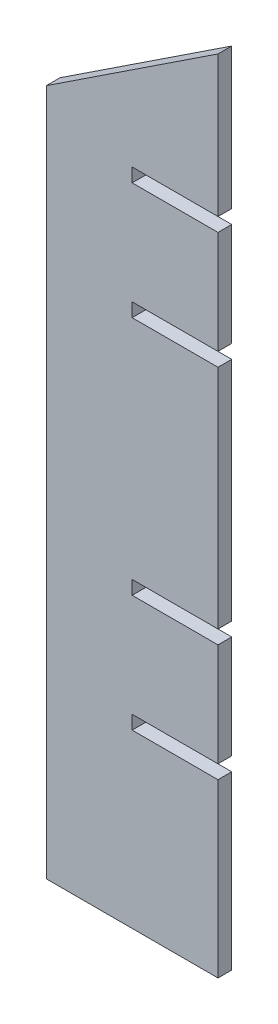
ISO-10303-21;
HEADER;
FILE_DESCRIPTION(('STEP AP214'),'2;1');
FILE_NAME('part.step','',(''),(''),'','','');
FILE_SCHEMA(('AUTOMOTIVE_DESIGN { 1 0 10303 214 1 1 1 1 }'));
ENDSEC;
DATA;
#1=APPLICATION_CONTEXT('core data for automotive mechanical design processes');
#2=APPLICATION_PROTOCOL_DEFINITION('international standard','automotive_design',2000,#1);
#3=PRODUCT_CONTEXT('',#1,'mechanical');
#4=PRODUCT('Part','Part','',(#3));
#5=PRODUCT_RELATED_PRODUCT_CATEGORY('part','',(#4));
#6=PRODUCT_DEFINITION_FORMATION('','',#4);
#7=PRODUCT_DEFINITION_CONTEXT('part definition',#1,'design');
#8=PRODUCT_DEFINITION('design','',#6,#7);
#9=PRODUCT_DEFINITION_SHAPE('','',#8);
#10=(LENGTH_UNIT() NAMED_UNIT(*) SI_UNIT(.MILLI.,.METRE.));
#11=(NAMED_UNIT(*) PLANE_ANGLE_UNIT() SI_UNIT($,.RADIAN.));
#12=(NAMED_UNIT(*) SI_UNIT($,.STERADIAN.) SOLID_ANGLE_UNIT());
#13=UNCERTAINTY_MEASURE_WITH_UNIT(LENGTH_MEASURE(1.E-05),#10,'distance_accuracy_value','');
#14=(GEOMETRIC_REPRESENTATION_CONTEXT(3) GLOBAL_UNCERTAINTY_ASSIGNED_CONTEXT((#13)) GLOBAL_UNIT_ASSIGNED_CONTEXT((#10,
#11,#12)) REPRESENTATION_CONTEXT('',''));
#15=CARTESIAN_POINT('',(0.,0.,0.));
#16=DIRECTION('',(0.,0.,1.));
#17=DIRECTION('',(1.,0.,0.));
#18=AXIS2_PLACEMENT_3D('',#15,#16,#17);
#19=CARTESIAN_POINT('',(-64.0648701838016,170.682235242793,4.));
#20=DIRECTION('',(0.550842208330738,-0.834609406561726,0.));
#21=DIRECTION('',(0.834609406561726,0.550842208330738,0.));
#22=AXIS2_PLACEMENT_3D('',#19,#20,#21);
#23=PLANE('',#22);
#24=DIRECTION('',(-0.834609406561726,-0.550842208330738,0.));
#25=VECTOR('',#24,1.);
#26=CARTESIAN_POINT('',(-64.0648701838016,170.682235242793,0.));
#27=LINE('',#26,#25);
#28=CARTESIAN_POINT('',(-64.0648701838016,170.682235242793,0.));
#29=VERTEX_POINT('',#28);
#30=CARTESIAN_POINT('',(-114.064870183802,137.682235242793,0.));
#31=VERTEX_POINT('',#30);
#32=EDGE_CURVE('E199',#29,#31,#27,.T.);
#33=ORIENTED_EDGE('',*,*,#32,.T.);
#34=DIRECTION('',(0.,0.,-1.));
#35=VECTOR('',#34,1.);
#36=CARTESIAN_POINT('',(-114.064870183802,137.682235242793,4.));
#37=LINE('',#36,#35);
#38=CARTESIAN_POINT('',(-114.064870183802,137.682235242793,4.));
#39=VERTEX_POINT('',#38);
#40=EDGE_CURVE('E11',#39,#31,#37,.T.);
#41=ORIENTED_EDGE('',*,*,#40,.F.);
#42=DIRECTION('',(-0.834609406561726,-0.550842208330738,0.));
#43=VECTOR('',#42,1.);
#44=CARTESIAN_POINT('',(-64.0648701838016,170.682235242793,4.));
#45=LINE('',#44,#43);
#46=CARTESIAN_POINT('',(-64.0648701838016,170.682235242793,4.));
#47=VERTEX_POINT('',#46);
#48=EDGE_CURVE('E237',#47,#39,#45,.T.);
#49=ORIENTED_EDGE('',*,*,#48,.F.);
#50=DIRECTION('',(0.,0.,-1.));
#51=VECTOR('',#50,1.);
#52=CARTESIAN_POINT('',(-64.0648701838016,170.682235242793,4.));
#53=LINE('',#52,#51);
#54=EDGE_CURVE('E195',#47,#29,#53,.T.);
#55=ORIENTED_EDGE('',*,*,#54,.T.);
#56=EDGE_LOOP('',(#33,#41,#49,#55));
#57=FACE_BOUND('',#56,.T.);
#58=ADVANCED_FACE('F31',(#57),#23,.F.);
#59=CARTESIAN_POINT('',(-114.064870183802,137.682235242793,4.));
#60=DIRECTION('',(1.,0.,0.));
#61=DIRECTION('',(0.,1.,0.));
#62=AXIS2_PLACEMENT_3D('',#59,#60,#61);
#63=PLANE('',#62);
#64=DIRECTION('',(0.,-1.,0.));
#65=VECTOR('',#64,1.);
#66=CARTESIAN_POINT('',(-114.064870183802,137.682235242793,0.));
#67=LINE('',#66,#65);
#68=CARTESIAN_POINT('',(-114.064870183802,-62.3177647572069,0.));
#69=VERTEX_POINT('',#68);
#70=EDGE_CURVE('E202',#31,#69,#67,.T.);
#71=ORIENTED_EDGE('',*,*,#70,.T.);
#72=DIRECTION('',(0.,0.,-1.));
#73=VECTOR('',#72,1.);
#74=CARTESIAN_POINT('',(-114.064870183802,-62.3177647572069,4.));
#75=LINE('',#74,#73);
#76=CARTESIAN_POINT('',(-114.064870183802,-62.3177647572069,4.));
#77=VERTEX_POINT('',#76);
#78=EDGE_CURVE('E39',#77,#69,#75,.T.);
#79=ORIENTED_EDGE('',*,*,#78,.F.);
#80=DIRECTION('',(0.,-1.,0.));
#81=VECTOR('',#80,1.);
#82=CARTESIAN_POINT('',(-114.064870183802,137.682235242793,4.));
#83=LINE('',#82,#81);
#84=EDGE_CURVE('E126',#39,#77,#83,.T.);
#85=ORIENTED_EDGE('',*,*,#84,.F.);
#86=ORIENTED_EDGE('',*,*,#40,.T.);
#87=EDGE_LOOP('',(#71,#79,#85,#86));
#88=FACE_BOUND('',#87,.T.);
#89=ADVANCED_FACE('F355',(#88),#63,.F.);
#90=CARTESIAN_POINT('',(-114.064870183802,-62.3177647572069,4.));
#91=DIRECTION('',(0.,1.,0.));
#92=DIRECTION('',(0.,0.,1.));
#93=AXIS2_PLACEMENT_3D('',#90,#91,#92);
#94=PLANE('',#93);
#95=DIRECTION('',(1.,0.,0.));
#96=VECTOR('',#95,1.);
#97=CARTESIAN_POINT('',(-114.064870183802,-62.3177647572069,0.));
#98=LINE('',#97,#96);
#99=CARTESIAN_POINT('',(-64.0648701838017,-62.3177647572069,0.));
#100=VERTEX_POINT('',#99);
#101=EDGE_CURVE('E204',#69,#100,#98,.T.);
#102=ORIENTED_EDGE('',*,*,#101,.T.);
#103=DIRECTION('',(0.,0.,-1.));
#104=VECTOR('',#103,1.);
#105=CARTESIAN_POINT('',(-64.0648701838017,-62.3177647572069,4.));
#106=LINE('',#105,#104);
#107=CARTESIAN_POINT('',(-64.0648701838017,-62.3177647572069,4.));
#108=VERTEX_POINT('',#107);
#109=EDGE_CURVE('E280',#108,#100,#106,.T.);
#110=ORIENTED_EDGE('',*,*,#109,.F.);
#111=DIRECTION('',(1.,0.,0.));
#112=VECTOR('',#111,1.);
#113=CARTESIAN_POINT('',(-114.064870183802,-62.3177647572069,4.));
#114=LINE('',#113,#112);
#115=EDGE_CURVE('E288',#77,#108,#114,.T.);
#116=ORIENTED_EDGE('',*,*,#115,.F.);
#117=ORIENTED_EDGE('',*,*,#78,.T.);
#118=EDGE_LOOP('',(#102,#110,#116,#117));
#119=FACE_BOUND('',#118,.T.);
#120=ADVANCED_FACE('F286',(#119),#94,.F.);
#121=CARTESIAN_POINT('',(-64.0648701838017,-62.3177647572069,4.));
#122=DIRECTION('',(-1.,0.,0.));
#123=DIRECTION('',(0.,0.,1.));
#124=AXIS2_PLACEMENT_3D('',#121,#122,#123);
#125=PLANE('',#124);
#126=DIRECTION('',(0.,1.,0.));
#127=VECTOR('',#126,1.);
#128=CARTESIAN_POINT('',(-64.0648701838017,-62.3177647572069,0.));
#129=LINE('',#128,#127);
#130=CARTESIAN_POINT('',(-64.0648701838017,-12.3177647572069,0.));
#131=VERTEX_POINT('',#130);
#132=EDGE_CURVE('E206',#100,#131,#129,.T.);
#133=ORIENTED_EDGE('',*,*,#132,.T.);
#134=DIRECTION('',(0.,0.,-1.));
#135=VECTOR('',#134,1.);
#136=CARTESIAN_POINT('',(-64.0648701838017,-12.3177647572069,4.));
#137=LINE('',#136,#135);
#138=CARTESIAN_POINT('',(-64.0648701838017,-12.3177647572069,4.));
#139=VERTEX_POINT('',#138);
#140=EDGE_CURVE('E277',#139,#131,#137,.T.);
#141=ORIENTED_EDGE('',*,*,#140,.F.);
#142=DIRECTION('',(0.,1.,0.));
#143=VECTOR('',#142,1.);
#144=CARTESIAN_POINT('',(-64.0648701838017,-62.3177647572069,4.));
#145=LINE('',#144,#143);
#146=EDGE_CURVE('E306',#108,#139,#145,.T.);
#147=ORIENTED_EDGE('',*,*,#146,.F.);
#148=ORIENTED_EDGE('',*,*,#109,.T.);
#149=EDGE_LOOP('',(#133,#141,#147,#148));
#150=FACE_BOUND('',#149,.T.);
#151=ADVANCED_FACE('F297',(#150),#125,.F.);
#152=CARTESIAN_POINT('',(-64.0648701838017,-12.3177647572069,4.));
#153=DIRECTION('',(0.,-1.,0.));
#154=DIRECTION('',(1.,0.,0.));
#155=AXIS2_PLACEMENT_3D('',#152,#153,#154);
#156=PLANE('',#155);
#157=DIRECTION('',(-1.,0.,0.));
#158=VECTOR('',#157,1.);
#159=CARTESIAN_POINT('',(-64.0648701838017,-12.3177647572069,0.));
#160=LINE('',#159,#158);
#161=CARTESIAN_POINT('',(-89.0648701838017,-12.3177647572069,0.));
#162=VERTEX_POINT('',#161);
#163=EDGE_CURVE('E208',#131,#162,#160,.T.);
#164=ORIENTED_EDGE('',*,*,#163,.T.);
#165=DIRECTION('',(0.,0.,-1.));
#166=VECTOR('',#165,1.);
#167=CARTESIAN_POINT('',(-89.0648701838017,-12.3177647572069,4.));
#168=LINE('',#167,#166);
#169=CARTESIAN_POINT('',(-89.0648701838017,-12.3177647572069,4.));
#170=VERTEX_POINT('',#169);
#171=EDGE_CURVE('E274',#170,#162,#168,.T.);
#172=ORIENTED_EDGE('',*,*,#171,.F.);
#173=DIRECTION('',(-1.,0.,0.));
#174=VECTOR('',#173,1.);
#175=CARTESIAN_POINT('',(-64.0648701838017,-12.3177647572069,4.));
#176=LINE('',#175,#174);
#177=EDGE_CURVE('E303',#139,#170,#176,.T.);
#178=ORIENTED_EDGE('',*,*,#177,.F.);
#179=ORIENTED_EDGE('',*,*,#140,.T.);
#180=EDGE_LOOP('',(#164,#172,#178,#179));
#181=FACE_BOUND('',#180,.T.);
#182=ADVANCED_FACE('F301',(#181),#156,.F.);
#183=CARTESIAN_POINT('',(-89.0648701838017,-12.3177647572069,4.));
#184=DIRECTION('',(-1.,0.,0.));
#185=DIRECTION('',(0.,0.,1.));
#186=AXIS2_PLACEMENT_3D('',#183,#184,#185);
#187=PLANE('',#186);
#188=DIRECTION('',(0.,1.,0.));
#189=VECTOR('',#188,1.);
#190=CARTESIAN_POINT('',(-89.0648701838017,-12.3177647572069,0.));
#191=LINE('',#190,#189);
#192=CARTESIAN_POINT('',(-89.0648701838017,-8.31776475720686,0.));
#193=VERTEX_POINT('',#192);
#194=EDGE_CURVE('E210',#162,#193,#191,.T.);
#195=ORIENTED_EDGE('',*,*,#194,.T.);
#196=DIRECTION('',(0.,0.,-1.));
#197=VECTOR('',#196,1.);
#198=CARTESIAN_POINT('',(-89.0648701838017,-8.31776475720686,4.));
#199=LINE('',#198,#197);
#200=CARTESIAN_POINT('',(-89.0648701838017,-8.31776475720686,4.));
#201=VERTEX_POINT('',#200);
#202=EDGE_CURVE('E271',#201,#193,#199,.T.);
#203=ORIENTED_EDGE('',*,*,#202,.F.);
#204=DIRECTION('',(0.,1.,0.));
#205=VECTOR('',#204,1.);
#206=CARTESIAN_POINT('',(-89.0648701838017,-12.3177647572069,4.));
#207=LINE('',#206,#205);
#208=EDGE_CURVE('E305',#170,#201,#207,.T.);
#209=ORIENTED_EDGE('',*,*,#208,.F.);
#210=ORIENTED_EDGE('',*,*,#171,.T.);
#211=EDGE_LOOP('',(#195,#203,#209,#210));
#212=FACE_BOUND('',#211,.T.);
#213=ADVANCED_FACE('F368',(#212),#187,.F.);
#214=CARTESIAN_POINT('',(-89.0648701838017,-8.31776475720686,4.));
#215=DIRECTION('',(0.,1.,0.));
#216=DIRECTION('',(-1.,0.,0.));
#217=AXIS2_PLACEMENT_3D('',#214,#215,#216);
#218=PLANE('',#217);
#219=DIRECTION('',(1.,0.,0.));
#220=VECTOR('',#219,1.);
#221=CARTESIAN_POINT('',(-89.0648701838017,-8.31776475720686,0.));
#222=LINE('',#221,#220);
#223=CARTESIAN_POINT('',(-64.0648701838017,-8.31776475720686,0.));
#224=VERTEX_POINT('',#223);
#225=EDGE_CURVE('E212',#193,#224,#222,.T.);
#226=ORIENTED_EDGE('',*,*,#225,.T.);
#227=DIRECTION('',(0.,0.,-1.));
#228=VECTOR('',#227,1.);
#229=CARTESIAN_POINT('',(-64.0648701838017,-8.31776475720686,4.));
#230=LINE('',#229,#228);
#231=CARTESIAN_POINT('',(-64.0648701838017,-8.31776475720686,4.));
#232=VERTEX_POINT('',#231);
#233=EDGE_CURVE('E268',#232,#224,#230,.T.);
#234=ORIENTED_EDGE('',*,*,#233,.F.);
#235=DIRECTION('',(1.,0.,0.));
#236=VECTOR('',#235,1.);
#237=CARTESIAN_POINT('',(-89.0648701838017,-8.31776475720686,4.));
#238=LINE('',#237,#236);
#239=EDGE_CURVE('E308',#201,#232,#238,.T.);
#240=ORIENTED_EDGE('',*,*,#239,.F.);
#241=ORIENTED_EDGE('',*,*,#202,.T.);
#242=EDGE_LOOP('',(#226,#234,#240,#241));
#243=FACE_BOUND('',#242,.T.);
#244=ADVANCED_FACE('F371',(#243),#218,.F.);
#245=CARTESIAN_POINT('',(-64.0648701838017,-8.31776475720686,4.));
#246=DIRECTION('',(-1.,0.,0.));
#247=DIRECTION('',(0.,0.,1.));
#248=AXIS2_PLACEMENT_3D('',#245,#246,#247);
#249=PLANE('',#248);
#250=DIRECTION('',(0.,1.,0.));
#251=VECTOR('',#250,1.);
#252=CARTESIAN_POINT('',(-64.0648701838017,-8.31776475720686,0.));
#253=LINE('',#252,#251);
#254=CARTESIAN_POINT('',(-64.0648701838017,21.6822352427931,0.));
#255=VERTEX_POINT('',#254);
#256=EDGE_CURVE('E214',#224,#255,#253,.T.);
#257=ORIENTED_EDGE('',*,*,#256,.T.);
#258=DIRECTION('',(0.,0.,-1.));
#259=VECTOR('',#258,1.);
#260=CARTESIAN_POINT('',(-64.0648701838017,21.6822352427931,4.));
#261=LINE('',#260,#259);
#262=CARTESIAN_POINT('',(-64.0648701838017,21.6822352427931,4.));
#263=VERTEX_POINT('',#262);
#264=EDGE_CURVE('E265',#263,#255,#261,.T.);
#265=ORIENTED_EDGE('',*,*,#264,.F.);
#266=DIRECTION('',(0.,1.,0.));
#267=VECTOR('',#266,1.);
#268=CARTESIAN_POINT('',(-64.0648701838017,-8.31776475720686,4.));
#269=LINE('',#268,#267);
#270=EDGE_CURVE('E314',#232,#263,#269,.T.);
#271=ORIENTED_EDGE('',*,*,#270,.F.);
#272=ORIENTED_EDGE('',*,*,#233,.T.);
#273=EDGE_LOOP('',(#257,#265,#271,#272));
#274=FACE_BOUND('',#273,.T.);
#275=ADVANCED_FACE('F375',(#274),#249,.F.);
#276=CARTESIAN_POINT('',(-64.0648701838017,21.6822352427931,4.));
#277=DIRECTION('',(0.,-1.,0.));
#278=DIRECTION('',(1.,0.,0.));
#279=AXIS2_PLACEMENT_3D('',#276,#277,#278);
#280=PLANE('',#279);
#281=DIRECTION('',(-1.,0.,0.));
#282=VECTOR('',#281,1.);
#283=CARTESIAN_POINT('',(-64.0648701838017,21.6822352427931,0.));
#284=LINE('',#283,#282);
#285=CARTESIAN_POINT('',(-89.0648701838017,21.6822352427931,0.));
#286=VERTEX_POINT('',#285);
#287=EDGE_CURVE('E216',#255,#286,#284,.T.);
#288=ORIENTED_EDGE('',*,*,#287,.T.);
#289=DIRECTION('',(0.,0.,-1.));
#290=VECTOR('',#289,1.);
#291=CARTESIAN_POINT('',(-89.0648701838017,21.6822352427931,4.));
#292=LINE('',#291,#290);
#293=CARTESIAN_POINT('',(-89.0648701838017,21.6822352427931,4.));
#294=VERTEX_POINT('',#293);
#295=EDGE_CURVE('E262',#294,#286,#292,.T.);
#296=ORIENTED_EDGE('',*,*,#295,.F.);
#297=DIRECTION('',(-1.,0.,0.));
#298=VECTOR('',#297,1.);
#299=CARTESIAN_POINT('',(-64.0648701838017,21.6822352427931,4.));
#300=LINE('',#299,#298);
#301=EDGE_CURVE('E316',#263,#294,#300,.T.);
#302=ORIENTED_EDGE('',*,*,#301,.F.);
#303=ORIENTED_EDGE('',*,*,#264,.T.);
#304=EDGE_LOOP('',(#288,#296,#302,#303));
#305=FACE_BOUND('',#304,.T.);
#306=ADVANCED_FACE('F379',(#305),#280,.F.);
#307=CARTESIAN_POINT('',(-89.0648701838017,21.6822352427931,4.));
#308=DIRECTION('',(-1.,0.,0.));
#309=DIRECTION('',(0.,0.,1.));
#310=AXIS2_PLACEMENT_3D('',#307,#308,#309);
#311=PLANE('',#310);
#312=DIRECTION('',(0.,1.,0.));
#313=VECTOR('',#312,1.);
#314=CARTESIAN_POINT('',(-89.0648701838017,21.6822352427931,0.));
#315=LINE('',#314,#313);
#316=CARTESIAN_POINT('',(-89.0648701838017,25.6822352427931,0.));
#317=VERTEX_POINT('',#316);
#318=EDGE_CURVE('E218',#286,#317,#315,.T.);
#319=ORIENTED_EDGE('',*,*,#318,.T.);
#320=DIRECTION('',(0.,0.,-1.));
#321=VECTOR('',#320,1.);
#322=CARTESIAN_POINT('',(-89.0648701838017,25.6822352427931,4.));
#323=LINE('',#322,#321);
#324=CARTESIAN_POINT('',(-89.0648701838017,25.6822352427931,4.));
#325=VERTEX_POINT('',#324);
#326=EDGE_CURVE('E259',#325,#317,#323,.T.);
#327=ORIENTED_EDGE('',*,*,#326,.F.);
#328=DIRECTION('',(0.,1.,0.));
#329=VECTOR('',#328,1.);
#330=CARTESIAN_POINT('',(-89.0648701838017,21.6822352427931,4.));
#331=LINE('',#330,#329);
#332=EDGE_CURVE('E318',#294,#325,#331,.T.);
#333=ORIENTED_EDGE('',*,*,#332,.F.);
#334=ORIENTED_EDGE('',*,*,#295,.T.);
#335=EDGE_LOOP('',(#319,#327,#333,#334));
#336=FACE_BOUND('',#335,.T.);
#337=ADVANCED_FACE('F383',(#336),#311,.F.);
#338=CARTESIAN_POINT('',(-89.0648701838017,25.6822352427931,4.));
#339=DIRECTION('',(0.,1.,0.));
#340=DIRECTION('',(0.,0.,1.));
#341=AXIS2_PLACEMENT_3D('',#338,#339,#340);
#342=PLANE('',#341);
#343=DIRECTION('',(1.,0.,0.));
#344=VECTOR('',#343,1.);
#345=CARTESIAN_POINT('',(-89.0648701838017,25.6822352427931,0.));
#346=LINE('',#345,#344);
#347=CARTESIAN_POINT('',(-64.0648701838017,25.6822352427931,0.));
#348=VERTEX_POINT('',#347);
#349=EDGE_CURVE('E220',#317,#348,#346,.T.);
#350=ORIENTED_EDGE('',*,*,#349,.T.);
#351=DIRECTION('',(0.,0.,-1.));
#352=VECTOR('',#351,1.);
#353=CARTESIAN_POINT('',(-64.0648701838017,25.6822352427931,4.));
#354=LINE('',#353,#352);
#355=CARTESIAN_POINT('',(-64.0648701838017,25.6822352427931,4.));
#356=VERTEX_POINT('',#355);
#357=EDGE_CURVE('E256',#356,#348,#354,.T.);
#358=ORIENTED_EDGE('',*,*,#357,.F.);
#359=DIRECTION('',(1.,0.,0.));
#360=VECTOR('',#359,1.);
#361=CARTESIAN_POINT('',(-89.0648701838017,25.6822352427931,4.));
#362=LINE('',#361,#360);
#363=EDGE_CURVE('E320',#325,#356,#362,.T.);
#364=ORIENTED_EDGE('',*,*,#363,.F.);
#365=ORIENTED_EDGE('',*,*,#326,.T.);
#366=EDGE_LOOP('',(#350,#358,#364,#365));
#367=FACE_BOUND('',#366,.T.);
#368=ADVANCED_FACE('F387',(#367),#342,.F.);
#369=CARTESIAN_POINT('',(-64.0648701838017,25.6822352427931,4.));
#370=DIRECTION('',(-1.,0.,0.));
#371=DIRECTION('',(0.,0.,1.));
#372=AXIS2_PLACEMENT_3D('',#369,#370,#371);
#373=PLANE('',#372);
#374=DIRECTION('',(0.,1.,0.));
#375=VECTOR('',#374,1.);
#376=CARTESIAN_POINT('',(-64.0648701838017,25.6822352427931,0.));
#377=LINE('',#376,#375);
#378=CARTESIAN_POINT('',(-64.0648701838017,91.6822352427931,0.));
#379=VERTEX_POINT('',#378);
#380=EDGE_CURVE('E222',#348,#379,#377,.T.);
#381=ORIENTED_EDGE('',*,*,#380,.T.);
#382=DIRECTION('',(0.,0.,-1.));
#383=VECTOR('',#382,1.);
#384=CARTESIAN_POINT('',(-64.0648701838017,91.6822352427931,4.));
#385=LINE('',#384,#383);
#386=CARTESIAN_POINT('',(-64.0648701838017,91.6822352427931,4.));
#387=VERTEX_POINT('',#386);
#388=EDGE_CURVE('E253',#387,#379,#385,.T.);
#389=ORIENTED_EDGE('',*,*,#388,.F.);
#390=DIRECTION('',(0.,1.,0.));
#391=VECTOR('',#390,1.);
#392=CARTESIAN_POINT('',(-64.0648701838017,25.6822352427931,4.));
#393=LINE('',#392,#391);
#394=EDGE_CURVE('E322',#356,#387,#393,.T.);
#395=ORIENTED_EDGE('',*,*,#394,.F.);
#396=ORIENTED_EDGE('',*,*,#357,.T.);
#397=EDGE_LOOP('',(#381,#389,#395,#396));
#398=FACE_BOUND('',#397,.T.);
#399=ADVANCED_FACE('F391',(#398),#373,.F.);
#400=CARTESIAN_POINT('',(-64.0648701838017,91.6822352427931,4.));
#401=DIRECTION('',(0.,-1.,0.));
#402=DIRECTION('',(0.,0.,-1.));
#403=AXIS2_PLACEMENT_3D('',#400,#401,#402);
#404=PLANE('',#403);
#405=DIRECTION('',(-1.,0.,0.));
#406=VECTOR('',#405,1.);
#407=CARTESIAN_POINT('',(-64.0648701838017,91.6822352427931,0.));
#408=LINE('',#407,#406);
#409=CARTESIAN_POINT('',(-89.0648701838017,91.6822352427931,0.));
#410=VERTEX_POINT('',#409);
#411=EDGE_CURVE('E224',#379,#410,#408,.T.);
#412=ORIENTED_EDGE('',*,*,#411,.T.);
#413=DIRECTION('',(0.,0.,-1.));
#414=VECTOR('',#413,1.);
#415=CARTESIAN_POINT('',(-89.0648701838017,91.6822352427931,4.));
#416=LINE('',#415,#414);
#417=CARTESIAN_POINT('',(-89.0648701838017,91.6822352427931,4.));
#418=VERTEX_POINT('',#417);
#419=EDGE_CURVE('E250',#418,#410,#416,.T.);
#420=ORIENTED_EDGE('',*,*,#419,.F.);
#421=DIRECTION('',(-1.,0.,0.));
#422=VECTOR('',#421,1.);
#423=CARTESIAN_POINT('',(-64.0648701838017,91.6822352427931,4.));
#424=LINE('',#423,#422);
#425=EDGE_CURVE('E324',#387,#418,#424,.T.);
#426=ORIENTED_EDGE('',*,*,#425,.F.);
#427=ORIENTED_EDGE('',*,*,#388,.T.);
#428=EDGE_LOOP('',(#412,#420,#426,#427));
#429=FACE_BOUND('',#428,.T.);
#430=ADVANCED_FACE('F395',(#429),#404,.F.);
#431=CARTESIAN_POINT('',(-89.0648701838017,91.6822352427931,4.));
#432=DIRECTION('',(-1.,0.,0.));
#433=DIRECTION('',(0.,0.,1.));
#434=AXIS2_PLACEMENT_3D('',#431,#432,#433);
#435=PLANE('',#434);
#436=DIRECTION('',(0.,1.,0.));
#437=VECTOR('',#436,1.);
#438=CARTESIAN_POINT('',(-89.0648701838017,91.6822352427931,0.));
#439=LINE('',#438,#437);
#440=CARTESIAN_POINT('',(-89.0648701838017,95.6822352427932,0.));
#441=VERTEX_POINT('',#440);
#442=EDGE_CURVE('E226',#410,#441,#439,.T.);
#443=ORIENTED_EDGE('',*,*,#442,.T.);
#444=DIRECTION('',(0.,0.,-1.));
#445=VECTOR('',#444,1.);
#446=CARTESIAN_POINT('',(-89.0648701838017,95.6822352427932,4.));
#447=LINE('',#446,#445);
#448=CARTESIAN_POINT('',(-89.0648701838017,95.6822352427932,4.));
#449=VERTEX_POINT('',#448);
#450=EDGE_CURVE('E247',#449,#441,#447,.T.);
#451=ORIENTED_EDGE('',*,*,#450,.F.);
#452=DIRECTION('',(0.,1.,0.));
#453=VECTOR('',#452,1.);
#454=CARTESIAN_POINT('',(-89.0648701838017,91.6822352427931,4.));
#455=LINE('',#454,#453);
#456=EDGE_CURVE('E326',#418,#449,#455,.T.);
#457=ORIENTED_EDGE('',*,*,#456,.F.);
#458=ORIENTED_EDGE('',*,*,#419,.T.);
#459=EDGE_LOOP('',(#443,#451,#457,#458));
#460=FACE_BOUND('',#459,.T.);
#461=ADVANCED_FACE('F399',(#460),#435,.F.);
#462=CARTESIAN_POINT('',(-89.0648701838017,95.6822352427932,4.));
#463=DIRECTION('',(0.,1.,0.));
#464=DIRECTION('',(0.,0.,1.));
#465=AXIS2_PLACEMENT_3D('',#462,#463,#464);
#466=PLANE('',#465);
#467=DIRECTION('',(1.,0.,0.));
#468=VECTOR('',#467,1.);
#469=CARTESIAN_POINT('',(-89.0648701838017,95.6822352427932,0.));
#470=LINE('',#469,#468);
#471=CARTESIAN_POINT('',(-64.0648701838017,95.6822352427932,0.));
#472=VERTEX_POINT('',#471);
#473=EDGE_CURVE('E228',#441,#472,#470,.T.);
#474=ORIENTED_EDGE('',*,*,#473,.T.);
#475=DIRECTION('',(0.,0.,-1.));
#476=VECTOR('',#475,1.);
#477=CARTESIAN_POINT('',(-64.0648701838017,95.6822352427932,4.));
#478=LINE('',#477,#476);
#479=CARTESIAN_POINT('',(-64.0648701838017,95.6822352427932,4.));
#480=VERTEX_POINT('',#479);
#481=EDGE_CURVE('E244',#480,#472,#478,.T.);
#482=ORIENTED_EDGE('',*,*,#481,.F.);
#483=DIRECTION('',(1.,0.,0.));
#484=VECTOR('',#483,1.);
#485=CARTESIAN_POINT('',(-89.0648701838017,95.6822352427932,4.));
#486=LINE('',#485,#484);
#487=EDGE_CURVE('E328',#449,#480,#486,.T.);
#488=ORIENTED_EDGE('',*,*,#487,.F.);
#489=ORIENTED_EDGE('',*,*,#450,.T.);
#490=EDGE_LOOP('',(#474,#482,#488,#489));
#491=FACE_BOUND('',#490,.T.);
#492=ADVANCED_FACE('F403',(#491),#466,.F.);
#493=CARTESIAN_POINT('',(-64.0648701838017,95.6822352427932,4.));
#494=DIRECTION('',(-1.,0.,0.));
#495=DIRECTION('',(0.,0.,1.));
#496=AXIS2_PLACEMENT_3D('',#493,#494,#495);
#497=PLANE('',#496);
#498=DIRECTION('',(0.,1.,0.));
#499=VECTOR('',#498,1.);
#500=CARTESIAN_POINT('',(-64.0648701838017,95.6822352427932,0.));
#501=LINE('',#500,#499);
#502=CARTESIAN_POINT('',(-64.0648701838017,125.682235242793,0.));
#503=VERTEX_POINT('',#502);
#504=EDGE_CURVE('E230',#472,#503,#501,.T.);
#505=ORIENTED_EDGE('',*,*,#504,.T.);
#506=DIRECTION('',(0.,0.,-1.));
#507=VECTOR('',#506,1.);
#508=CARTESIAN_POINT('',(-64.0648701838017,125.682235242793,4.));
#509=LINE('',#508,#507);
#510=CARTESIAN_POINT('',(-64.0648701838017,125.682235242793,4.));
#511=VERTEX_POINT('',#510);
#512=EDGE_CURVE('E241',#511,#503,#509,.T.);
#513=ORIENTED_EDGE('',*,*,#512,.F.);
#514=DIRECTION('',(0.,1.,0.));
#515=VECTOR('',#514,1.);
#516=CARTESIAN_POINT('',(-64.0648701838017,95.6822352427932,4.));
#517=LINE('',#516,#515);
#518=EDGE_CURVE('E330',#480,#511,#517,.T.);
#519=ORIENTED_EDGE('',*,*,#518,.F.);
#520=ORIENTED_EDGE('',*,*,#481,.T.);
#521=EDGE_LOOP('',(#505,#513,#519,#520));
#522=FACE_BOUND('',#521,.T.);
#523=ADVANCED_FACE('F336',(#522),#497,.F.);
#524=CARTESIAN_POINT('',(-64.0648701838017,125.682235242793,4.));
#525=DIRECTION('',(0.,-1.,0.));
#526=DIRECTION('',(0.,0.,-1.));
#527=AXIS2_PLACEMENT_3D('',#524,#525,#526);
#528=PLANE('',#527);
#529=DIRECTION('',(-1.,0.,0.));
#530=VECTOR('',#529,1.);
#531=CARTESIAN_POINT('',(-64.0648701838017,125.682235242793,0.));
#532=LINE('',#531,#530);
#533=CARTESIAN_POINT('',(-89.0648701838017,125.682235242793,0.));
#534=VERTEX_POINT('',#533);
#535=EDGE_CURVE('E232',#503,#534,#532,.T.);
#536=ORIENTED_EDGE('',*,*,#535,.T.);
#537=DIRECTION('',(0.,0.,-1.));
#538=VECTOR('',#537,1.);
#539=CARTESIAN_POINT('',(-89.0648701838017,125.682235242793,4.));
#540=LINE('',#539,#538);
#541=CARTESIAN_POINT('',(-89.0648701838017,125.682235242793,4.));
#542=VERTEX_POINT('',#541);
#543=EDGE_CURVE('E190',#542,#534,#540,.T.);
#544=ORIENTED_EDGE('',*,*,#543,.F.);
#545=DIRECTION('',(-1.,0.,0.));
#546=VECTOR('',#545,1.);
#547=CARTESIAN_POINT('',(-64.0648701838017,125.682235242793,4.));
#548=LINE('',#547,#546);
#549=EDGE_CURVE('E181',#511,#542,#548,.T.);
#550=ORIENTED_EDGE('',*,*,#549,.F.);
#551=ORIENTED_EDGE('',*,*,#512,.T.);
#552=EDGE_LOOP('',(#536,#544,#550,#551));
#553=FACE_BOUND('',#552,.T.);
#554=ADVANCED_FACE('F340',(#553),#528,.F.);
#555=CARTESIAN_POINT('',(-89.0648701838017,125.682235242793,4.));
#556=DIRECTION('',(-1.,0.,0.));
#557=DIRECTION('',(0.,0.,1.));
#558=AXIS2_PLACEMENT_3D('',#555,#556,#557);
#559=PLANE('',#558);
#560=DIRECTION('',(0.,1.,0.));
#561=VECTOR('',#560,1.);
#562=CARTESIAN_POINT('',(-89.0648701838017,125.682235242793,0.));
#563=LINE('',#562,#561);
#564=CARTESIAN_POINT('',(-89.0648701838017,129.682235242793,0.));
#565=VERTEX_POINT('',#564);
#566=EDGE_CURVE('E189',#534,#565,#563,.T.);
#567=ORIENTED_EDGE('',*,*,#566,.T.);
#568=DIRECTION('',(0.,0.,-1.));
#569=VECTOR('',#568,1.);
#570=CARTESIAN_POINT('',(-89.0648701838017,129.682235242793,4.));
#571=LINE('',#570,#569);
#572=CARTESIAN_POINT('',(-89.0648701838017,129.682235242793,4.));
#573=VERTEX_POINT('',#572);
#574=EDGE_CURVE('E186',#573,#565,#571,.T.);
#575=ORIENTED_EDGE('',*,*,#574,.F.);
#576=DIRECTION('',(0.,1.,0.));
#577=VECTOR('',#576,1.);
#578=CARTESIAN_POINT('',(-89.0648701838017,125.682235242793,4.));
#579=LINE('',#578,#577);
#580=EDGE_CURVE('E175',#542,#573,#579,.T.);
#581=ORIENTED_EDGE('',*,*,#580,.F.);
#582=ORIENTED_EDGE('',*,*,#543,.T.);
#583=EDGE_LOOP('',(#567,#575,#581,#582));
#584=FACE_BOUND('',#583,.T.);
#585=ADVANCED_FACE('F187',(#584),#559,.F.);
#586=CARTESIAN_POINT('',(-89.0648701838017,129.682235242793,4.));
#587=DIRECTION('',(0.,1.,0.));
#588=DIRECTION('',(0.,0.,1.));
#589=AXIS2_PLACEMENT_3D('',#586,#587,#588);
#590=PLANE('',#589);
#591=DIRECTION('',(1.,0.,0.));
#592=VECTOR('',#591,1.);
#593=CARTESIAN_POINT('',(-89.0648701838017,129.682235242793,0.));
#594=LINE('',#593,#592);
#595=CARTESIAN_POINT('',(-64.0648701838017,129.682235242793,0.));
#596=VERTEX_POINT('',#595);
#597=EDGE_CURVE('E112',#565,#596,#594,.T.);
#598=ORIENTED_EDGE('',*,*,#597,.T.);
#599=DIRECTION('',(0.,0.,-1.));
#600=VECTOR('',#599,1.);
#601=CARTESIAN_POINT('',(-64.0648701838017,129.682235242793,4.));
#602=LINE('',#601,#600);
#603=CARTESIAN_POINT('',(-64.0648701838017,129.682235242793,4.));
#604=VERTEX_POINT('',#603);
#605=EDGE_CURVE('E191',#604,#596,#602,.T.);
#606=ORIENTED_EDGE('',*,*,#605,.F.);
#607=DIRECTION('',(1.,0.,0.));
#608=VECTOR('',#607,1.);
#609=CARTESIAN_POINT('',(-89.0648701838017,129.682235242793,4.));
#610=LINE('',#609,#608);
#611=EDGE_CURVE('E179',#573,#604,#610,.T.);
#612=ORIENTED_EDGE('',*,*,#611,.F.);
#613=ORIENTED_EDGE('',*,*,#574,.T.);
#614=EDGE_LOOP('',(#598,#606,#612,#613));
#615=FACE_BOUND('',#614,.T.);
#616=ADVANCED_FACE('F193',(#615),#590,.F.);
#617=CARTESIAN_POINT('',(-64.0648701838017,129.682235242793,4.));
#618=DIRECTION('',(-1.,0.,0.));
#619=DIRECTION('',(0.,-1.,0.));
#620=AXIS2_PLACEMENT_3D('',#617,#618,#619);
#621=PLANE('',#620);
#622=DIRECTION('',(0.,1.,0.));
#623=VECTOR('',#622,1.);
#624=CARTESIAN_POINT('',(-64.0648701838017,129.682235242793,0.));
#625=LINE('',#624,#623);
#626=EDGE_CURVE('E118',#596,#29,#625,.T.);
#627=ORIENTED_EDGE('',*,*,#626,.T.);
#628=ORIENTED_EDGE('',*,*,#54,.F.);
#629=DIRECTION('',(0.,1.,0.));
#630=VECTOR('',#629,1.);
#631=CARTESIAN_POINT('',(-64.0648701838017,129.682235242793,4.));
#632=LINE('',#631,#630);
#633=EDGE_CURVE('E47',#604,#47,#632,.T.);
#634=ORIENTED_EDGE('',*,*,#633,.F.);
#635=ORIENTED_EDGE('',*,*,#605,.T.);
#636=EDGE_LOOP('',(#627,#628,#634,#635));
#637=FACE_BOUND('',#636,.T.);
#638=ADVANCED_FACE('F344',(#637),#621,.F.);
#639=CARTESIAN_POINT('',(-114.064870183802,137.682235242793,4.));
#640=DIRECTION('',(0.,0.,1.));
#641=DIRECTION('',(1.,0.,0.));
#642=AXIS2_PLACEMENT_3D('',#639,#640,#641);
#643=PLANE('',#642);
#644=ORIENTED_EDGE('',*,*,#48,.T.);
#645=ORIENTED_EDGE('',*,*,#84,.T.);
#646=ORIENTED_EDGE('',*,*,#115,.T.);
#647=ORIENTED_EDGE('',*,*,#146,.T.);
#648=ORIENTED_EDGE('',*,*,#177,.T.);
#649=ORIENTED_EDGE('',*,*,#208,.T.);
#650=ORIENTED_EDGE('',*,*,#239,.T.);
#651=ORIENTED_EDGE('',*,*,#270,.T.);
#652=ORIENTED_EDGE('',*,*,#301,.T.);
#653=ORIENTED_EDGE('',*,*,#332,.T.);
#654=ORIENTED_EDGE('',*,*,#363,.T.);
#655=ORIENTED_EDGE('',*,*,#394,.T.);
#656=ORIENTED_EDGE('',*,*,#425,.T.);
#657=ORIENTED_EDGE('',*,*,#456,.T.);
#658=ORIENTED_EDGE('',*,*,#487,.T.);
#659=ORIENTED_EDGE('',*,*,#518,.T.);
#660=ORIENTED_EDGE('',*,*,#549,.T.);
#661=ORIENTED_EDGE('',*,*,#580,.T.);
#662=ORIENTED_EDGE('',*,*,#611,.T.);
#663=ORIENTED_EDGE('',*,*,#633,.T.);
#664=EDGE_LOOP('',(#644,#645,#646,#647,#648,#649,#650,#651,#652,#653,#654,#655,#656,#657,#658,
#659,#660,#661,#662,#663));
#665=FACE_BOUND('',#664,.T.);
#666=ADVANCED_FACE('F177',(#665),#643,.T.);
#667=CARTESIAN_POINT('',(-114.064870183802,137.682235242793,0.));
#668=DIRECTION('',(0.,0.,1.));
#669=DIRECTION('',(1.,0.,0.));
#670=AXIS2_PLACEMENT_3D('',#667,#668,#669);
#671=PLANE('',#670);
#672=ORIENTED_EDGE('',*,*,#32,.F.);
#673=ORIENTED_EDGE('',*,*,#626,.F.);
#674=ORIENTED_EDGE('',*,*,#597,.F.);
#675=ORIENTED_EDGE('',*,*,#566,.F.);
#676=ORIENTED_EDGE('',*,*,#535,.F.);
#677=ORIENTED_EDGE('',*,*,#504,.F.);
#678=ORIENTED_EDGE('',*,*,#473,.F.);
#679=ORIENTED_EDGE('',*,*,#442,.F.);
#680=ORIENTED_EDGE('',*,*,#411,.F.);
#681=ORIENTED_EDGE('',*,*,#380,.F.);
#682=ORIENTED_EDGE('',*,*,#349,.F.);
#683=ORIENTED_EDGE('',*,*,#318,.F.);
#684=ORIENTED_EDGE('',*,*,#287,.F.);
#685=ORIENTED_EDGE('',*,*,#256,.F.);
#686=ORIENTED_EDGE('',*,*,#225,.F.);
#687=ORIENTED_EDGE('',*,*,#194,.F.);
#688=ORIENTED_EDGE('',*,*,#163,.F.);
#689=ORIENTED_EDGE('',*,*,#132,.F.);
#690=ORIENTED_EDGE('',*,*,#101,.F.);
#691=ORIENTED_EDGE('',*,*,#70,.F.);
#692=EDGE_LOOP('',(#672,#673,#674,#675,#676,#677,#678,#679,#680,#681,#682,#683,#684,#685,#686,
#687,#688,#689,#690,#691));
#693=FACE_BOUND('',#692,.T.);
#694=ADVANCED_FACE('F292',(#693),#671,.F.);
#695=CLOSED_SHELL('',(#58,#89,#120,#151,#182,#213,#244,#275,#306,#337,#368,#399,#430,#461,#492,
#523,#554,#585,#616,#638,#666,#694));
#696=MANIFOLD_SOLID_BREP('B2',#695);
#697=ADVANCED_BREP_SHAPE_REPRESENTATION('',(#18,#696),#14);
#698=SHAPE_DEFINITION_REPRESENTATION(#9,#697);
ENDSEC;
END-ISO-10303-21;
